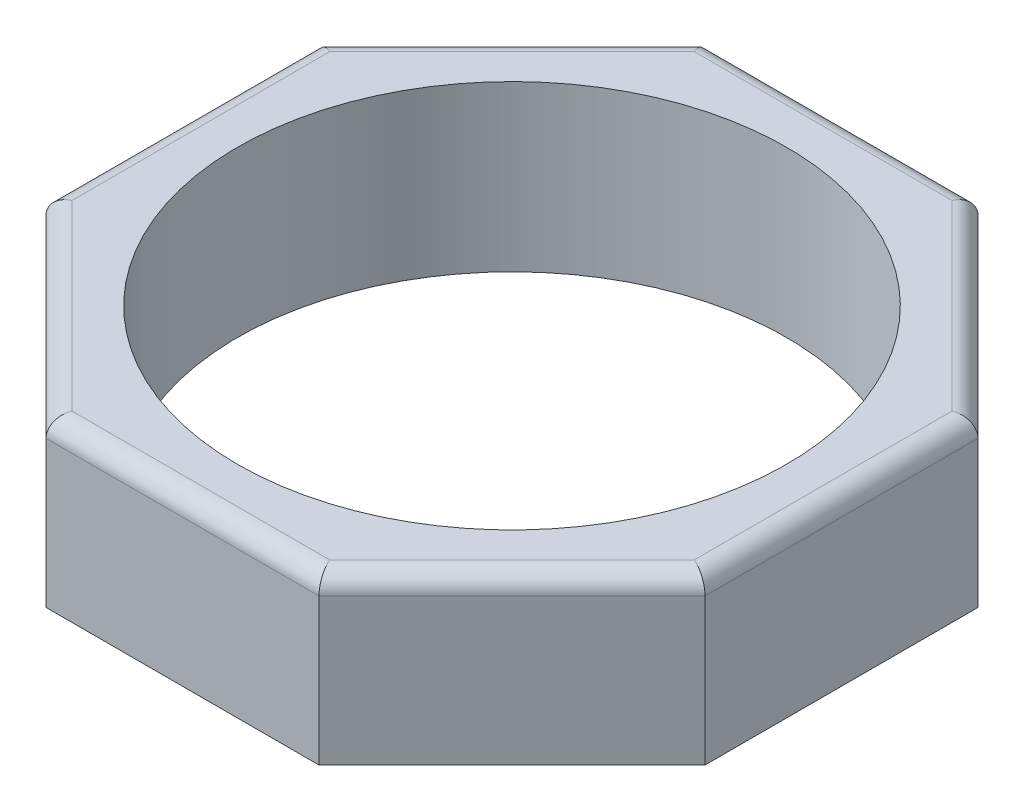
ISO-10303-21;
HEADER;
FILE_DESCRIPTION(('STEP AP214'),'2;1');
FILE_NAME('part.step','',(''),(''),'','','');
FILE_SCHEMA(('AUTOMOTIVE_DESIGN { 1 0 10303 214 1 1 1 1 }'));
ENDSEC;
DATA;
#1=APPLICATION_CONTEXT('core data for automotive mechanical design processes');
#2=APPLICATION_PROTOCOL_DEFINITION('international standard','automotive_design',2000,#1);
#3=PRODUCT_CONTEXT('',#1,'mechanical');
#4=PRODUCT('Part','Part','',(#3));
#5=PRODUCT_RELATED_PRODUCT_CATEGORY('part','',(#4));
#6=PRODUCT_DEFINITION_FORMATION('','',#4);
#7=PRODUCT_DEFINITION_CONTEXT('part definition',#1,'design');
#8=PRODUCT_DEFINITION('design','',#6,#7);
#9=PRODUCT_DEFINITION_SHAPE('','',#8);
#10=(LENGTH_UNIT() NAMED_UNIT(*) SI_UNIT(.MILLI.,.METRE.));
#11=(NAMED_UNIT(*) PLANE_ANGLE_UNIT() SI_UNIT($,.RADIAN.));
#12=(NAMED_UNIT(*) SI_UNIT($,.STERADIAN.) SOLID_ANGLE_UNIT());
#13=UNCERTAINTY_MEASURE_WITH_UNIT(LENGTH_MEASURE(1.E-05),#10,'distance_accuracy_value','');
#14=(GEOMETRIC_REPRESENTATION_CONTEXT(3) GLOBAL_UNCERTAINTY_ASSIGNED_CONTEXT((#13)) GLOBAL_UNIT_ASSIGNED_CONTEXT((#10,
#11,#12)) REPRESENTATION_CONTEXT('',''));
#15=CARTESIAN_POINT('',(0.,0.,0.));
#16=DIRECTION('',(0.,0.,1.));
#17=DIRECTION('',(1.,0.,0.));
#18=AXIS2_PLACEMENT_3D('',#15,#16,#17);
#19=CARTESIAN_POINT('',(18.,9.,7.45584412271572));
#20=DIRECTION('',(-1.,0.,0.));
#21=DIRECTION('',(0.,0.,1.));
#22=AXIS2_PLACEMENT_3D('',#19,#20,#21);
#23=PLANE('',#22);
#24=DIRECTION('',(0.,-1.,0.));
#25=VECTOR('',#24,1.);
#26=CARTESIAN_POINT('',(18.,9.,-7.45584412271571));
#27=LINE('',#26,#25);
#28=CARTESIAN_POINT('',(18.,8.,-7.45584412271571));
#29=VERTEX_POINT('',#28);
#30=CARTESIAN_POINT('',(18.,0.,-7.45584412271571));
#31=VERTEX_POINT('',#30);
#32=EDGE_CURVE('E127',#29,#31,#27,.T.);
#33=ORIENTED_EDGE('',*,*,#32,.F.);
#34=DIRECTION('',(0.,0.,-1.));
#35=VECTOR('',#34,1.);
#36=CARTESIAN_POINT('',(18.,8.,7.45584412271572));
#37=LINE('',#36,#35);
#38=CARTESIAN_POINT('',(18.,8.,7.45584412271572));
#39=VERTEX_POINT('',#38);
#40=EDGE_CURVE('E209',#29,#39,#37,.F.);
#41=ORIENTED_EDGE('',*,*,#40,.T.);
#42=DIRECTION('',(0.,-1.,0.));
#43=VECTOR('',#42,1.);
#44=CARTESIAN_POINT('',(18.,9.,7.45584412271572));
#45=LINE('',#44,#43);
#46=CARTESIAN_POINT('',(18.,0.,7.45584412271572));
#47=VERTEX_POINT('',#46);
#48=EDGE_CURVE('E151',#39,#47,#45,.T.);
#49=ORIENTED_EDGE('',*,*,#48,.T.);
#50=DIRECTION('',(0.,0.,-1.));
#51=VECTOR('',#50,1.);
#52=CARTESIAN_POINT('',(18.,0.,7.45584412271572));
#53=LINE('',#52,#51);
#54=EDGE_CURVE('E145',#47,#31,#53,.T.);
#55=ORIENTED_EDGE('',*,*,#54,.T.);
#56=EDGE_LOOP('',(#33,#41,#49,#55));
#57=FACE_BOUND('',#56,.T.);
#58=ADVANCED_FACE('F37',(#57),#23,.F.);
#59=CARTESIAN_POINT('',(18.,9.,-7.45584412271571));
#60=DIRECTION('',(-0.707106781186547,0.,0.707106781186548));
#61=DIRECTION('',(0.707106781186548,0.,0.707106781186547));
#62=AXIS2_PLACEMENT_3D('',#59,#60,#61);
#63=PLANE('',#62);
#64=DIRECTION('',(0.,-1.,0.));
#65=VECTOR('',#64,1.);
#66=CARTESIAN_POINT('',(7.45584412271571,9.,-18.));
#67=LINE('',#66,#65);
#68=CARTESIAN_POINT('',(7.45584412271571,8.,-18.));
#69=VERTEX_POINT('',#68);
#70=CARTESIAN_POINT('',(7.45584412271571,0.,-18.));
#71=VERTEX_POINT('',#70);
#72=EDGE_CURVE('E139',#69,#71,#67,.T.);
#73=ORIENTED_EDGE('',*,*,#72,.F.);
#74=DIRECTION('',(-0.707106781186548,0.,-0.707106781186547));
#75=VECTOR('',#74,1.);
#76=CARTESIAN_POINT('',(18.,8.,-7.45584412271571));
#77=LINE('',#76,#75);
#78=EDGE_CURVE('E134',#69,#29,#77,.F.);
#79=ORIENTED_EDGE('',*,*,#78,.T.);
#80=ORIENTED_EDGE('',*,*,#32,.T.);
#81=DIRECTION('',(-0.707106781186548,0.,-0.707106781186547));
#82=VECTOR('',#81,1.);
#83=CARTESIAN_POINT('',(18.,0.,-7.45584412271571));
#84=LINE('',#83,#82);
#85=EDGE_CURVE('E131',#31,#71,#84,.T.);
#86=ORIENTED_EDGE('',*,*,#85,.T.);
#87=EDGE_LOOP('',(#73,#79,#80,#86));
#88=FACE_BOUND('',#87,.T.);
#89=ADVANCED_FACE('F130',(#88),#63,.F.);
#90=CARTESIAN_POINT('',(7.45584412271571,9.,-18.));
#91=DIRECTION('',(0.,0.,1.));
#92=DIRECTION('',(1.,0.,0.));
#93=AXIS2_PLACEMENT_3D('',#90,#91,#92);
#94=PLANE('',#93);
#95=DIRECTION('',(0.,-1.,0.));
#96=VECTOR('',#95,1.);
#97=CARTESIAN_POINT('',(-7.45584412271571,9.,-18.));
#98=LINE('',#97,#96);
#99=CARTESIAN_POINT('',(-7.45584412271571,8.,-18.));
#100=VERTEX_POINT('',#99);
#101=CARTESIAN_POINT('',(-7.45584412271571,0.,-18.));
#102=VERTEX_POINT('',#101);
#103=EDGE_CURVE('E184',#100,#102,#98,.T.);
#104=ORIENTED_EDGE('',*,*,#103,.F.);
#105=DIRECTION('',(-1.,0.,0.));
#106=VECTOR('',#105,1.);
#107=CARTESIAN_POINT('',(7.45584412271571,8.,-18.));
#108=LINE('',#107,#106);
#109=EDGE_CURVE('E206',#100,#69,#108,.F.);
#110=ORIENTED_EDGE('',*,*,#109,.T.);
#111=ORIENTED_EDGE('',*,*,#72,.T.);
#112=DIRECTION('',(-1.,0.,0.));
#113=VECTOR('',#112,1.);
#114=CARTESIAN_POINT('',(7.45584412271571,0.,-18.));
#115=LINE('',#114,#113);
#116=EDGE_CURVE('E148',#71,#102,#115,.T.);
#117=ORIENTED_EDGE('',*,*,#116,.T.);
#118=EDGE_LOOP('',(#104,#110,#111,#117));
#119=FACE_BOUND('',#118,.T.);
#120=ADVANCED_FACE('F264',(#119),#94,.F.);
#121=CARTESIAN_POINT('',(-7.45584412271571,9.,-18.));
#122=DIRECTION('',(0.707106781186548,0.,0.707106781186547));
#123=DIRECTION('',(0.707106781186547,0.,-0.707106781186548));
#124=AXIS2_PLACEMENT_3D('',#121,#122,#123);
#125=PLANE('',#124);
#126=DIRECTION('',(0.,-1.,0.));
#127=VECTOR('',#126,1.);
#128=CARTESIAN_POINT('',(-18.,9.,-7.4558441227157));
#129=LINE('',#128,#127);
#130=CARTESIAN_POINT('',(-18.,8.,-7.4558441227157));
#131=VERTEX_POINT('',#130);
#132=CARTESIAN_POINT('',(-18.,0.,-7.4558441227157));
#133=VERTEX_POINT('',#132);
#134=EDGE_CURVE('E182',#131,#133,#129,.T.);
#135=ORIENTED_EDGE('',*,*,#134,.F.);
#136=DIRECTION('',(-0.707106781186547,0.,0.707106781186548));
#137=VECTOR('',#136,1.);
#138=CARTESIAN_POINT('',(-7.45584412271571,8.,-18.));
#139=LINE('',#138,#137);
#140=EDGE_CURVE('E203',#131,#100,#139,.F.);
#141=ORIENTED_EDGE('',*,*,#140,.T.);
#142=ORIENTED_EDGE('',*,*,#103,.T.);
#143=DIRECTION('',(-0.707106781186547,0.,0.707106781186548));
#144=VECTOR('',#143,1.);
#145=CARTESIAN_POINT('',(-7.45584412271571,0.,-18.));
#146=LINE('',#145,#144);
#147=EDGE_CURVE('E161',#102,#133,#146,.T.);
#148=ORIENTED_EDGE('',*,*,#147,.T.);
#149=EDGE_LOOP('',(#135,#141,#142,#148));
#150=FACE_BOUND('',#149,.T.);
#151=ADVANCED_FACE('F313',(#150),#125,.F.);
#152=CARTESIAN_POINT('',(-18.,9.,-7.4558441227157));
#153=DIRECTION('',(1.,0.,0.));
#154=DIRECTION('',(0.,0.,-1.));
#155=AXIS2_PLACEMENT_3D('',#152,#153,#154);
#156=PLANE('',#155);
#157=DIRECTION('',(0.,-1.,0.));
#158=VECTOR('',#157,1.);
#159=CARTESIAN_POINT('',(-18.,9.,7.45584412271571));
#160=LINE('',#159,#158);
#161=CARTESIAN_POINT('',(-18.,8.,7.45584412271571));
#162=VERTEX_POINT('',#161);
#163=CARTESIAN_POINT('',(-18.,0.,7.45584412271571));
#164=VERTEX_POINT('',#163);
#165=EDGE_CURVE('E180',#162,#164,#160,.T.);
#166=ORIENTED_EDGE('',*,*,#165,.F.);
#167=DIRECTION('',(0.,0.,1.));
#168=VECTOR('',#167,1.);
#169=CARTESIAN_POINT('',(-18.,8.,-7.4558441227157));
#170=LINE('',#169,#168);
#171=EDGE_CURVE('E11',#162,#131,#170,.F.);
#172=ORIENTED_EDGE('',*,*,#171,.T.);
#173=ORIENTED_EDGE('',*,*,#134,.T.);
#174=DIRECTION('',(0.,0.,1.));
#175=VECTOR('',#174,1.);
#176=CARTESIAN_POINT('',(-18.,0.,-7.4558441227157));
#177=LINE('',#176,#175);
#178=EDGE_CURVE('E164',#133,#164,#177,.T.);
#179=ORIENTED_EDGE('',*,*,#178,.T.);
#180=EDGE_LOOP('',(#166,#172,#173,#179));
#181=FACE_BOUND('',#180,.T.);
#182=ADVANCED_FACE('F310',(#181),#156,.F.);
#183=CARTESIAN_POINT('',(-18.,9.,7.45584412271571));
#184=DIRECTION('',(0.707106781186547,0.,-0.707106781186548));
#185=DIRECTION('',(-0.707106781186548,0.,-0.707106781186547));
#186=AXIS2_PLACEMENT_3D('',#183,#184,#185);
#187=PLANE('',#186);
#188=DIRECTION('',(0.,-1.,0.));
#189=VECTOR('',#188,1.);
#190=CARTESIAN_POINT('',(-7.45584412271569,9.,18.));
#191=LINE('',#190,#189);
#192=CARTESIAN_POINT('',(-7.45584412271569,8.,18.));
#193=VERTEX_POINT('',#192);
#194=CARTESIAN_POINT('',(-7.45584412271569,0.,18.));
#195=VERTEX_POINT('',#194);
#196=EDGE_CURVE('E178',#193,#195,#191,.T.);
#197=ORIENTED_EDGE('',*,*,#196,.F.);
#198=DIRECTION('',(0.707106781186548,0.,0.707106781186547));
#199=VECTOR('',#198,1.);
#200=CARTESIAN_POINT('',(-18.,8.,7.45584412271571));
#201=LINE('',#200,#199);
#202=EDGE_CURVE('E46',#193,#162,#201,.F.);
#203=ORIENTED_EDGE('',*,*,#202,.T.);
#204=ORIENTED_EDGE('',*,*,#165,.T.);
#205=DIRECTION('',(0.707106781186548,0.,0.707106781186547));
#206=VECTOR('',#205,1.);
#207=CARTESIAN_POINT('',(-18.,0.,7.45584412271571));
#208=LINE('',#207,#206);
#209=EDGE_CURVE('E167',#164,#195,#208,.T.);
#210=ORIENTED_EDGE('',*,*,#209,.T.);
#211=EDGE_LOOP('',(#197,#203,#204,#210));
#212=FACE_BOUND('',#211,.T.);
#213=ADVANCED_FACE('F326',(#212),#187,.F.);
#214=CARTESIAN_POINT('',(-7.45584412271569,9.,18.));
#215=DIRECTION('',(0.,0.,-1.));
#216=DIRECTION('',(-1.,0.,0.));
#217=AXIS2_PLACEMENT_3D('',#214,#215,#216);
#218=PLANE('',#217);
#219=DIRECTION('',(0.,-1.,0.));
#220=VECTOR('',#219,1.);
#221=CARTESIAN_POINT('',(7.45584412271571,9.,18.));
#222=LINE('',#221,#220);
#223=CARTESIAN_POINT('',(7.45584412271571,8.,18.));
#224=VERTEX_POINT('',#223);
#225=CARTESIAN_POINT('',(7.45584412271571,0.,18.));
#226=VERTEX_POINT('',#225);
#227=EDGE_CURVE('E176',#224,#226,#222,.T.);
#228=ORIENTED_EDGE('',*,*,#227,.F.);
#229=DIRECTION('',(1.,0.,0.));
#230=VECTOR('',#229,1.);
#231=CARTESIAN_POINT('',(-7.45584412271569,8.,18.));
#232=LINE('',#231,#230);
#233=EDGE_CURVE('E61',#224,#193,#232,.F.);
#234=ORIENTED_EDGE('',*,*,#233,.T.);
#235=ORIENTED_EDGE('',*,*,#196,.T.);
#236=DIRECTION('',(1.,0.,0.));
#237=VECTOR('',#236,1.);
#238=CARTESIAN_POINT('',(-7.45584412271569,0.,18.));
#239=LINE('',#238,#237);
#240=EDGE_CURVE('E170',#195,#226,#239,.T.);
#241=ORIENTED_EDGE('',*,*,#240,.T.);
#242=EDGE_LOOP('',(#228,#234,#235,#241));
#243=FACE_BOUND('',#242,.T.);
#244=ADVANCED_FACE('F255',(#243),#218,.F.);
#245=CARTESIAN_POINT('',(7.45584412271571,9.,18.));
#246=DIRECTION('',(-0.707106781186547,0.,-0.707106781186548));
#247=DIRECTION('',(-0.707106781186548,0.,0.707106781186547));
#248=AXIS2_PLACEMENT_3D('',#245,#246,#247);
#249=PLANE('',#248);
#250=ORIENTED_EDGE('',*,*,#48,.F.);
#251=DIRECTION('',(0.707106781186548,0.,-0.707106781186547));
#252=VECTOR('',#251,1.);
#253=CARTESIAN_POINT('',(7.45584412271571,8.,18.));
#254=LINE('',#253,#252);
#255=EDGE_CURVE('E211',#39,#224,#254,.F.);
#256=ORIENTED_EDGE('',*,*,#255,.T.);
#257=ORIENTED_EDGE('',*,*,#227,.T.);
#258=DIRECTION('',(0.707106781186548,0.,-0.707106781186547));
#259=VECTOR('',#258,1.);
#260=CARTESIAN_POINT('',(7.45584412271571,0.,18.));
#261=LINE('',#260,#259);
#262=EDGE_CURVE('E173',#226,#47,#261,.T.);
#263=ORIENTED_EDGE('',*,*,#262,.T.);
#264=EDGE_LOOP('',(#250,#256,#257,#263));
#265=FACE_BOUND('',#264,.T.);
#266=ADVANCED_FACE('F246',(#265),#249,.F.);
#267=CARTESIAN_POINT('',(0.,9.,0.));
#268=DIRECTION('',(0.,1.,0.));
#269=DIRECTION('',(0.,0.,1.));
#270=AXIS2_PLACEMENT_3D('',#267,#268,#269);
#271=PLANE('',#270);
#272=DIRECTION('',(-1.,0.,0.));
#273=VECTOR('',#272,1.);
#274=CARTESIAN_POINT('',(-7.45584412271571,9.,-17.));
#275=LINE('',#274,#273);
#276=CARTESIAN_POINT('',(7.04163056034262,9.,-17.));
#277=VERTEX_POINT('',#276);
#278=CARTESIAN_POINT('',(-7.04163056034262,9.,-17.));
#279=VERTEX_POINT('',#278);
#280=EDGE_CURVE('E198',#277,#279,#275,.T.);
#281=ORIENTED_EDGE('',*,*,#280,.T.);
#282=DIRECTION('',(-0.707106781186547,0.,0.707106781186548));
#283=VECTOR('',#282,1.);
#284=CARTESIAN_POINT('',(-17.2928932188135,9.,-6.74873734152916));
#285=LINE('',#284,#283);
#286=CARTESIAN_POINT('',(-17.,9.,-7.04163056034261));
#287=VERTEX_POINT('',#286);
#288=EDGE_CURVE('E200',#279,#287,#285,.T.);
#289=ORIENTED_EDGE('',*,*,#288,.T.);
#290=DIRECTION('',(0.,0.,1.));
#291=VECTOR('',#290,1.);
#292=CARTESIAN_POINT('',(-17.,9.,7.45584412271571));
#293=LINE('',#292,#291);
#294=CARTESIAN_POINT('',(-17.,9.,7.04163056034261));
#295=VERTEX_POINT('',#294);
#296=EDGE_CURVE('E138',#287,#295,#293,.T.);
#297=ORIENTED_EDGE('',*,*,#296,.T.);
#298=DIRECTION('',(0.707106781186548,0.,0.707106781186547));
#299=VECTOR('',#298,1.);
#300=CARTESIAN_POINT('',(-6.74873734152914,9.,17.2928932188135));
#301=LINE('',#300,#299);
#302=CARTESIAN_POINT('',(-7.04163056034259,9.,17.));
#303=VERTEX_POINT('',#302);
#304=EDGE_CURVE('E188',#295,#303,#301,.T.);
#305=ORIENTED_EDGE('',*,*,#304,.T.);
#306=DIRECTION('',(1.,0.,0.));
#307=VECTOR('',#306,1.);
#308=CARTESIAN_POINT('',(7.45584412271571,9.,17.));
#309=LINE('',#308,#307);
#310=CARTESIAN_POINT('',(7.04163056034261,9.,17.));
#311=VERTEX_POINT('',#310);
#312=EDGE_CURVE('E190',#303,#311,#309,.T.);
#313=ORIENTED_EDGE('',*,*,#312,.T.);
#314=DIRECTION('',(0.707106781186548,0.,-0.707106781186547));
#315=VECTOR('',#314,1.);
#316=CARTESIAN_POINT('',(17.2928932188135,9.,6.74873734152917));
#317=LINE('',#316,#315);
#318=CARTESIAN_POINT('',(17.,9.,7.04163056034262));
#319=VERTEX_POINT('',#318);
#320=EDGE_CURVE('E192',#311,#319,#317,.T.);
#321=ORIENTED_EDGE('',*,*,#320,.T.);
#322=DIRECTION('',(0.,0.,-1.));
#323=VECTOR('',#322,1.);
#324=CARTESIAN_POINT('',(17.,9.,-7.45584412271571));
#325=LINE('',#324,#323);
#326=CARTESIAN_POINT('',(17.,9.,-7.04163056034261));
#327=VERTEX_POINT('',#326);
#328=EDGE_CURVE('E194',#319,#327,#325,.T.);
#329=ORIENTED_EDGE('',*,*,#328,.T.);
#330=DIRECTION('',(-0.707106781186548,0.,-0.707106781186547));
#331=VECTOR('',#330,1.);
#332=CARTESIAN_POINT('',(6.74873734152916,9.,-17.2928932188134));
#333=LINE('',#332,#331);
#334=EDGE_CURVE('E196',#327,#277,#333,.T.);
#335=ORIENTED_EDGE('',*,*,#334,.T.);
#336=EDGE_LOOP('',(#281,#289,#297,#305,#313,#321,#329,#335));
#337=FACE_BOUND('',#336,.T.);
#338=CARTESIAN_POINT('',(0.,9.,0.));
#339=DIRECTION('',(0.,1.,0.));
#340=DIRECTION('',(0.,0.,1.));
#341=AXIS2_PLACEMENT_3D('',#338,#339,#340);
#342=CIRCLE('',#341,15.);
#343=CARTESIAN_POINT('',(0.,9.,15.));
#344=VERTEX_POINT('',#343);
#345=EDGE_CURVE('E156',#344,#344,#342,.T.);
#346=ORIENTED_EDGE('',*,*,#345,.F.);
#347=EDGE_LOOP('',(#346));
#348=FACE_BOUND('',#347,.T.);
#349=ADVANCED_FACE('F244',(#337,#348),#271,.T.);
#350=CARTESIAN_POINT('',(0.,0.,0.));
#351=DIRECTION('',(0.,1.,0.));
#352=DIRECTION('',(0.,0.,1.));
#353=AXIS2_PLACEMENT_3D('',#350,#351,#352);
#354=PLANE('',#353);
#355=CARTESIAN_POINT('',(0.,0.,0.));
#356=DIRECTION('',(0.,1.,0.));
#357=DIRECTION('',(0.,0.,1.));
#358=AXIS2_PLACEMENT_3D('',#355,#356,#357);
#359=CIRCLE('',#358,15.);
#360=CARTESIAN_POINT('',(0.,0.,15.));
#361=VERTEX_POINT('',#360);
#362=EDGE_CURVE('E153',#361,#361,#359,.T.);
#363=ORIENTED_EDGE('',*,*,#362,.T.);
#364=EDGE_LOOP('',(#363));
#365=FACE_BOUND('',#364,.T.);
#366=ORIENTED_EDGE('',*,*,#54,.F.);
#367=ORIENTED_EDGE('',*,*,#262,.F.);
#368=ORIENTED_EDGE('',*,*,#240,.F.);
#369=ORIENTED_EDGE('',*,*,#209,.F.);
#370=ORIENTED_EDGE('',*,*,#178,.F.);
#371=ORIENTED_EDGE('',*,*,#147,.F.);
#372=ORIENTED_EDGE('',*,*,#116,.F.);
#373=ORIENTED_EDGE('',*,*,#85,.F.);
#374=EDGE_LOOP('',(#366,#367,#368,#369,#370,#371,#372,#373));
#375=FACE_BOUND('',#374,.T.);
#376=ADVANCED_FACE('F143',(#365,#375),#354,.F.);
#377=CARTESIAN_POINT('',(0.,0.,0.));
#378=DIRECTION('',(0.,1.,0.));
#379=DIRECTION('',(0.,0.,1.));
#380=AXIS2_PLACEMENT_3D('',#377,#378,#379);
#381=CYLINDRICAL_SURFACE('',#380,15.);
#382=ORIENTED_EDGE('',*,*,#362,.F.);
#383=EDGE_LOOP('',(#382));
#384=FACE_BOUND('',#383,.T.);
#385=ORIENTED_EDGE('',*,*,#345,.T.);
#386=EDGE_LOOP('',(#385));
#387=FACE_BOUND('',#386,.T.);
#388=ADVANCED_FACE('F242',(#384,#387),#381,.F.);
#389=CARTESIAN_POINT('',(12.0208152801713,8.,12.0208152801713));
#390=DIRECTION('',(-0.707106781186548,0.,0.707106781186547));
#391=DIRECTION('',(0.707106781186547,0.,0.707106781186548));
#392=AXIS2_PLACEMENT_3D('',#389,#390,#391);
#393=CYLINDRICAL_SURFACE('',#392,1.);
#394=CARTESIAN_POINT('',(7.04163056034261,8.,17.));
#395=DIRECTION('',(-0.923879532511287,0.,0.38268343236509));
#396=DIRECTION('',(-0.38268343236509,0.,-0.923879532511287));
#397=AXIS2_PLACEMENT_3D('',#394,#395,#396);
#398=ELLIPSE('',#397,1.08239220029239,1.);
#399=EDGE_CURVE('E230',#224,#311,#398,.T.);
#400=ORIENTED_EDGE('',*,*,#399,.F.);
#401=ORIENTED_EDGE('',*,*,#255,.F.);
#402=CARTESIAN_POINT('',(17.,8.,7.04163056034262));
#403=DIRECTION('',(-0.38268343236509,0.,0.923879532511287));
#404=DIRECTION('',(-0.923879532511287,0.,-0.38268343236509));
#405=AXIS2_PLACEMENT_3D('',#402,#403,#404);
#406=ELLIPSE('',#405,1.08239220029239,1.);
#407=EDGE_CURVE('E41',#319,#39,#406,.F.);
#408=ORIENTED_EDGE('',*,*,#407,.F.);
#409=ORIENTED_EDGE('',*,*,#320,.F.);
#410=EDGE_LOOP('',(#400,#401,#408,#409));
#411=FACE_BOUND('',#410,.T.);
#412=ADVANCED_FACE('F39',(#411),#393,.T.);
#413=CARTESIAN_POINT('',(17.,8.,0.));
#414=DIRECTION('',(0.,0.,1.));
#415=DIRECTION('',(1.,0.,0.));
#416=AXIS2_PLACEMENT_3D('',#413,#414,#415);
#417=CYLINDRICAL_SURFACE('',#416,1.);
#418=ORIENTED_EDGE('',*,*,#407,.T.);
#419=ORIENTED_EDGE('',*,*,#40,.F.);
#420=CARTESIAN_POINT('',(17.,8.,-7.04163056034261));
#421=DIRECTION('',(0.38268343236509,0.,0.923879532511287));
#422=DIRECTION('',(-0.923879532511287,0.,0.38268343236509));
#423=AXIS2_PLACEMENT_3D('',#420,#421,#422);
#424=ELLIPSE('',#423,1.08239220029239,1.);
#425=EDGE_CURVE('E228',#327,#29,#424,.F.);
#426=ORIENTED_EDGE('',*,*,#425,.F.);
#427=ORIENTED_EDGE('',*,*,#328,.F.);
#428=EDGE_LOOP('',(#418,#419,#426,#427));
#429=FACE_BOUND('',#428,.T.);
#430=ADVANCED_FACE('F290',(#429),#417,.T.);
#431=CARTESIAN_POINT('',(0.,8.,17.));
#432=DIRECTION('',(-1.,0.,0.));
#433=DIRECTION('',(0.,0.,1.));
#434=AXIS2_PLACEMENT_3D('',#431,#432,#433);
#435=CYLINDRICAL_SURFACE('',#434,1.);
#436=ORIENTED_EDGE('',*,*,#399,.T.);
#437=ORIENTED_EDGE('',*,*,#312,.F.);
#438=CARTESIAN_POINT('',(-7.04163056034259,8.,17.));
#439=DIRECTION('',(-0.923879532511287,0.,-0.38268343236509));
#440=DIRECTION('',(0.38268343236509,0.,-0.923879532511287));
#441=AXIS2_PLACEMENT_3D('',#438,#439,#440);
#442=ELLIPSE('',#441,1.08239220029239,1.);
#443=EDGE_CURVE('E225',#193,#303,#442,.T.);
#444=ORIENTED_EDGE('',*,*,#443,.F.);
#445=ORIENTED_EDGE('',*,*,#233,.F.);
#446=EDGE_LOOP('',(#436,#437,#444,#445));
#447=FACE_BOUND('',#446,.T.);
#448=ADVANCED_FACE('F287',(#447),#435,.T.);
#449=CARTESIAN_POINT('',(12.0208152801713,8.,-12.0208152801713));
#450=DIRECTION('',(0.707106781186548,0.,0.707106781186547));
#451=DIRECTION('',(0.707106781186547,0.,-0.707106781186548));
#452=AXIS2_PLACEMENT_3D('',#449,#450,#451);
#453=CYLINDRICAL_SURFACE('',#452,1.);
#454=ORIENTED_EDGE('',*,*,#425,.T.);
#455=ORIENTED_EDGE('',*,*,#78,.F.);
#456=CARTESIAN_POINT('',(7.04163056034262,8.,-17.));
#457=DIRECTION('',(0.923879532511287,0.,0.38268343236509));
#458=DIRECTION('',(-0.38268343236509,0.,0.923879532511287));
#459=AXIS2_PLACEMENT_3D('',#456,#457,#458);
#460=ELLIPSE('',#459,1.08239220029239,1.);
#461=EDGE_CURVE('E222',#277,#69,#460,.F.);
#462=ORIENTED_EDGE('',*,*,#461,.F.);
#463=ORIENTED_EDGE('',*,*,#334,.F.);
#464=EDGE_LOOP('',(#454,#455,#462,#463));
#465=FACE_BOUND('',#464,.T.);
#466=ADVANCED_FACE('F283',(#465),#453,.T.);
#467=CARTESIAN_POINT('',(-12.0208152801713,8.,12.0208152801713));
#468=DIRECTION('',(-0.707106781186548,0.,-0.707106781186547));
#469=DIRECTION('',(-0.707106781186547,0.,0.707106781186548));
#470=AXIS2_PLACEMENT_3D('',#467,#468,#469);
#471=CYLINDRICAL_SURFACE('',#470,1.);
#472=ORIENTED_EDGE('',*,*,#443,.T.);
#473=ORIENTED_EDGE('',*,*,#304,.F.);
#474=CARTESIAN_POINT('',(-17.,8.,7.04163056034261));
#475=DIRECTION('',(-0.38268343236509,0.,-0.923879532511287));
#476=DIRECTION('',(0.923879532511287,0.,-0.38268343236509));
#477=AXIS2_PLACEMENT_3D('',#474,#475,#476);
#478=ELLIPSE('',#477,1.08239220029239,1.);
#479=EDGE_CURVE('E219',#162,#295,#478,.T.);
#480=ORIENTED_EDGE('',*,*,#479,.F.);
#481=ORIENTED_EDGE('',*,*,#202,.F.);
#482=EDGE_LOOP('',(#472,#473,#480,#481));
#483=FACE_BOUND('',#482,.T.);
#484=ADVANCED_FACE('F279',(#483),#471,.T.);
#485=CARTESIAN_POINT('',(0.,8.,-17.));
#486=DIRECTION('',(1.,0.,0.));
#487=DIRECTION('',(0.,0.,-1.));
#488=AXIS2_PLACEMENT_3D('',#485,#486,#487);
#489=CYLINDRICAL_SURFACE('',#488,1.);
#490=ORIENTED_EDGE('',*,*,#461,.T.);
#491=ORIENTED_EDGE('',*,*,#109,.F.);
#492=CARTESIAN_POINT('',(-7.04163056034262,8.,-17.));
#493=DIRECTION('',(0.923879532511287,0.,-0.38268343236509));
#494=DIRECTION('',(0.38268343236509,0.,0.923879532511287));
#495=AXIS2_PLACEMENT_3D('',#492,#493,#494);
#496=ELLIPSE('',#495,1.08239220029239,1.);
#497=EDGE_CURVE('E217',#279,#100,#496,.F.);
#498=ORIENTED_EDGE('',*,*,#497,.F.);
#499=ORIENTED_EDGE('',*,*,#280,.F.);
#500=EDGE_LOOP('',(#490,#491,#498,#499));
#501=FACE_BOUND('',#500,.T.);
#502=ADVANCED_FACE('F275',(#501),#489,.T.);
#503=CARTESIAN_POINT('',(-17.,8.,0.));
#504=DIRECTION('',(0.,0.,-1.));
#505=DIRECTION('',(-1.,0.,0.));
#506=AXIS2_PLACEMENT_3D('',#503,#504,#505);
#507=CYLINDRICAL_SURFACE('',#506,1.);
#508=ORIENTED_EDGE('',*,*,#479,.T.);
#509=ORIENTED_EDGE('',*,*,#296,.F.);
#510=CARTESIAN_POINT('',(-17.,8.,-7.04163056034261));
#511=DIRECTION('',(0.38268343236509,0.,-0.923879532511287));
#512=DIRECTION('',(-0.923879532511287,0.,-0.38268343236509));
#513=AXIS2_PLACEMENT_3D('',#510,#511,#512);
#514=ELLIPSE('',#513,1.08239220029239,1.);
#515=EDGE_CURVE('E215',#131,#287,#514,.T.);
#516=ORIENTED_EDGE('',*,*,#515,.F.);
#517=ORIENTED_EDGE('',*,*,#171,.F.);
#518=EDGE_LOOP('',(#508,#509,#516,#517));
#519=FACE_BOUND('',#518,.T.);
#520=ADVANCED_FACE('F271',(#519),#507,.T.);
#521=CARTESIAN_POINT('',(-12.0208152801713,8.,-12.0208152801713));
#522=DIRECTION('',(0.707106781186547,0.,-0.707106781186548));
#523=DIRECTION('',(-0.707106781186548,0.,-0.707106781186547));
#524=AXIS2_PLACEMENT_3D('',#521,#522,#523);
#525=CYLINDRICAL_SURFACE('',#524,1.);
#526=ORIENTED_EDGE('',*,*,#497,.T.);
#527=ORIENTED_EDGE('',*,*,#140,.F.);
#528=ORIENTED_EDGE('',*,*,#515,.T.);
#529=ORIENTED_EDGE('',*,*,#288,.F.);
#530=EDGE_LOOP('',(#526,#527,#528,#529));
#531=FACE_BOUND('',#530,.T.);
#532=ADVANCED_FACE('F268',(#531),#525,.T.);
#533=CLOSED_SHELL('',(#58,#89,#120,#151,#182,#213,#244,#266,#349,#376,#388,#412,#430,#448,#466,
#484,#502,#520,#532));
#534=MANIFOLD_SOLID_BREP('B2',#533);
#535=ADVANCED_BREP_SHAPE_REPRESENTATION('',(#18,#534),#14);
#536=SHAPE_DEFINITION_REPRESENTATION(#9,#535);
ENDSEC;
END-ISO-10303-21;
